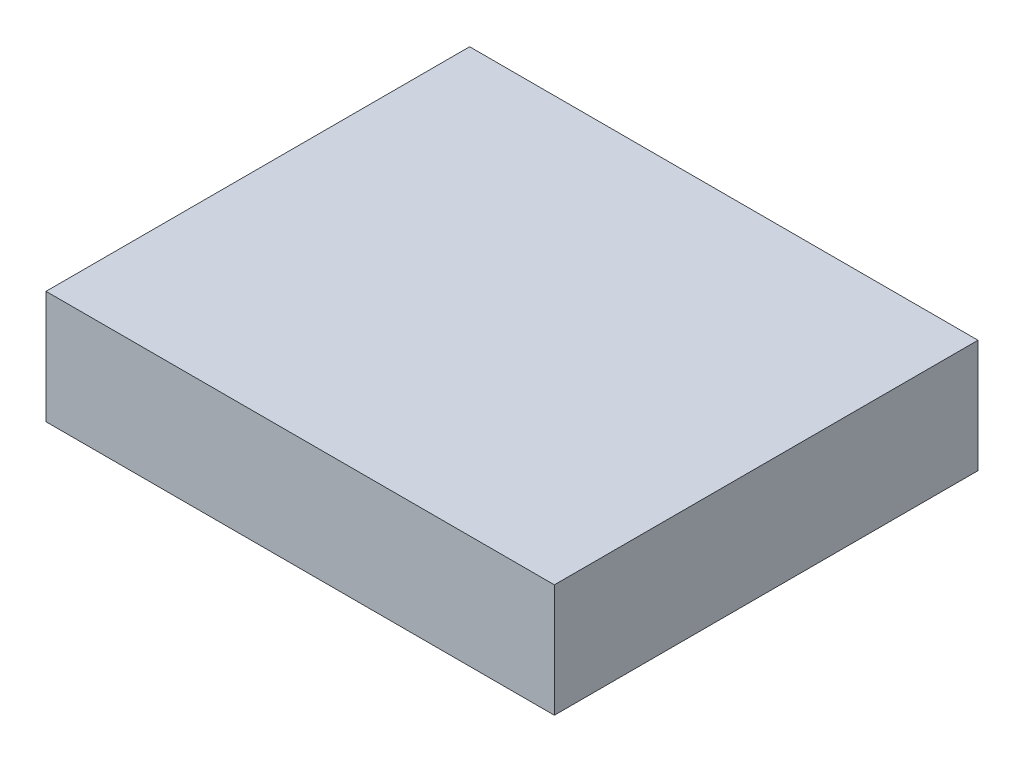
ISO-10303-21;
HEADER;
FILE_DESCRIPTION(('STEP AP214'),'2;1');
FILE_NAME('part.step','',(''),(''),'','','');
FILE_SCHEMA(('AUTOMOTIVE_DESIGN { 1 0 10303 214 1 1 1 1 }'));
ENDSEC;
DATA;
#1=APPLICATION_CONTEXT('core data for automotive mechanical design processes');
#2=APPLICATION_PROTOCOL_DEFINITION('international standard','automotive_design',2000,#1);
#3=PRODUCT_CONTEXT('',#1,'mechanical');
#4=PRODUCT('Part','Part','',(#3));
#5=PRODUCT_RELATED_PRODUCT_CATEGORY('part','',(#4));
#6=PRODUCT_DEFINITION_FORMATION('','',#4);
#7=PRODUCT_DEFINITION_CONTEXT('part definition',#1,'design');
#8=PRODUCT_DEFINITION('design','',#6,#7);
#9=PRODUCT_DEFINITION_SHAPE('','',#8);
#10=(LENGTH_UNIT() NAMED_UNIT(*) SI_UNIT(.MILLI.,.METRE.));
#11=(NAMED_UNIT(*) PLANE_ANGLE_UNIT() SI_UNIT($,.RADIAN.));
#12=(NAMED_UNIT(*) SI_UNIT($,.STERADIAN.) SOLID_ANGLE_UNIT());
#13=UNCERTAINTY_MEASURE_WITH_UNIT(LENGTH_MEASURE(1.E-05),#10,'distance_accuracy_value','');
#14=(GEOMETRIC_REPRESENTATION_CONTEXT(3) GLOBAL_UNCERTAINTY_ASSIGNED_CONTEXT((#13)) GLOBAL_UNIT_ASSIGNED_CONTEXT((#10,
#11,#12)) REPRESENTATION_CONTEXT('',''));
#15=CARTESIAN_POINT('',(0.,0.,0.));
#16=DIRECTION('',(0.,0.,1.));
#17=DIRECTION('',(1.,0.,0.));
#18=AXIS2_PLACEMENT_3D('',#15,#16,#17);
#19=CARTESIAN_POINT('',(-6.3,0.199999999999998,-11.85));
#20=DIRECTION('',(0.,1.,0.));
#21=DIRECTION('',(0.,0.,1.));
#22=AXIS2_PLACEMENT_3D('',#19,#20,#21);
#23=PLANE('',#22);
#24=DIRECTION('',(-1.,0.,0.));
#25=VECTOR('',#24,1.);
#26=CARTESIAN_POINT('',(-4.5,0.199999999999998,-10.35));
#27=LINE('',#26,#25);
#28=CARTESIAN_POINT('',(-6.3,0.199999999999998,-10.35));
#29=VERTEX_POINT('',#28);
#30=CARTESIAN_POINT('',(-4.5,0.199999999999998,-10.35));
#31=VERTEX_POINT('',#30);
#32=EDGE_CURVE('E54',#29,#31,#27,.F.);
#33=ORIENTED_EDGE('',*,*,#32,.T.);
#34=DIRECTION('',(0.,0.,1.));
#35=VECTOR('',#34,1.);
#36=CARTESIAN_POINT('',(-4.5,0.199999999999998,-11.85));
#37=LINE('',#36,#35);
#38=CARTESIAN_POINT('',(-4.5,0.199999999999998,-11.85));
#39=VERTEX_POINT('',#38);
#40=EDGE_CURVE('E75',#31,#39,#37,.F.);
#41=ORIENTED_EDGE('',*,*,#40,.T.);
#42=DIRECTION('',(1.,0.,0.));
#43=VECTOR('',#42,1.);
#44=CARTESIAN_POINT('',(-4.5,0.199999999999998,-11.85));
#45=LINE('',#44,#43);
#46=CARTESIAN_POINT('',(-6.3,0.199999999999998,-11.85));
#47=VERTEX_POINT('',#46);
#48=EDGE_CURVE('E57',#39,#47,#45,.F.);
#49=ORIENTED_EDGE('',*,*,#48,.T.);
#50=DIRECTION('',(0.,0.,-1.));
#51=VECTOR('',#50,1.);
#52=CARTESIAN_POINT('',(-6.3,0.199999999999998,-11.85));
#53=LINE('',#52,#51);
#54=EDGE_CURVE('E19',#47,#29,#53,.F.);
#55=ORIENTED_EDGE('',*,*,#54,.T.);
#56=EDGE_LOOP('',(#33,#41,#49,#55));
#57=FACE_BOUND('',#56,.T.);
#58=ADVANCED_FACE('F16',(#57),#23,.T.);
#59=CARTESIAN_POINT('',(-6.3,-0.200000000000001,-11.85));
#60=DIRECTION('',(1.,0.,0.));
#61=DIRECTION('',(0.,0.,-1.));
#62=AXIS2_PLACEMENT_3D('',#59,#60,#61);
#63=PLANE('',#62);
#64=ORIENTED_EDGE('',*,*,#54,.F.);
#65=DIRECTION('',(0.,1.,0.));
#66=VECTOR('',#65,1.);
#67=CARTESIAN_POINT('',(-6.3,-0.200000000000001,-11.85));
#68=LINE('',#67,#66);
#69=CARTESIAN_POINT('',(-6.3,-0.200000000000001,-11.85));
#70=VERTEX_POINT('',#69);
#71=EDGE_CURVE('E79',#47,#70,#68,.F.);
#72=ORIENTED_EDGE('',*,*,#71,.T.);
#73=DIRECTION('',(0.,0.,1.));
#74=VECTOR('',#73,1.);
#75=CARTESIAN_POINT('',(-6.3,-0.200000000000001,-11.85));
#76=LINE('',#75,#74);
#77=CARTESIAN_POINT('',(-6.3,-0.200000000000001,-10.35));
#78=VERTEX_POINT('',#77);
#79=EDGE_CURVE('E72',#70,#78,#76,.T.);
#80=ORIENTED_EDGE('',*,*,#79,.T.);
#81=DIRECTION('',(0.,1.,0.));
#82=VECTOR('',#81,1.);
#83=CARTESIAN_POINT('',(-6.3,-0.200000000000001,-10.35));
#84=LINE('',#83,#82);
#85=EDGE_CURVE('E62',#78,#29,#84,.T.);
#86=ORIENTED_EDGE('',*,*,#85,.T.);
#87=EDGE_LOOP('',(#64,#72,#80,#86));
#88=FACE_BOUND('',#87,.T.);
#89=ADVANCED_FACE('F71',(#88),#63,.F.);
#90=CARTESIAN_POINT('',(-4.5,-0.200000000000001,-10.35));
#91=DIRECTION('',(0.,0.,-1.));
#92=DIRECTION('',(-1.,0.,0.));
#93=AXIS2_PLACEMENT_3D('',#90,#91,#92);
#94=PLANE('',#93);
#95=ORIENTED_EDGE('',*,*,#32,.F.);
#96=ORIENTED_EDGE('',*,*,#85,.F.);
#97=DIRECTION('',(1.,0.,0.));
#98=VECTOR('',#97,1.);
#99=CARTESIAN_POINT('',(-6.3,-0.200000000000001,-10.35));
#100=LINE('',#99,#98);
#101=CARTESIAN_POINT('',(-4.5,-0.200000000000001,-10.35));
#102=VERTEX_POINT('',#101);
#103=EDGE_CURVE('E82',#78,#102,#100,.T.);
#104=ORIENTED_EDGE('',*,*,#103,.T.);
#105=DIRECTION('',(0.,1.,0.));
#106=VECTOR('',#105,1.);
#107=CARTESIAN_POINT('',(-4.5,-0.200000000000001,-10.35));
#108=LINE('',#107,#106);
#109=EDGE_CURVE('E68',#102,#31,#108,.T.);
#110=ORIENTED_EDGE('',*,*,#109,.T.);
#111=EDGE_LOOP('',(#95,#96,#104,#110));
#112=FACE_BOUND('',#111,.T.);
#113=ADVANCED_FACE('F65',(#112),#94,.F.);
#114=CARTESIAN_POINT('',(-4.5,-0.200000000000001,-11.85));
#115=DIRECTION('',(-1.,0.,0.));
#116=DIRECTION('',(0.,0.,1.));
#117=AXIS2_PLACEMENT_3D('',#114,#115,#116);
#118=PLANE('',#117);
#119=ORIENTED_EDGE('',*,*,#40,.F.);
#120=ORIENTED_EDGE('',*,*,#109,.F.);
#121=DIRECTION('',(0.,0.,1.));
#122=VECTOR('',#121,1.);
#123=CARTESIAN_POINT('',(-4.5,-0.200000000000001,-11.85));
#124=LINE('',#123,#122);
#125=CARTESIAN_POINT('',(-4.5,-0.200000000000001,-11.85));
#126=VERTEX_POINT('',#125);
#127=EDGE_CURVE('E25',#102,#126,#124,.F.);
#128=ORIENTED_EDGE('',*,*,#127,.T.);
#129=DIRECTION('',(0.,1.,0.));
#130=VECTOR('',#129,1.);
#131=CARTESIAN_POINT('',(-4.5,-0.200000000000001,-11.85));
#132=LINE('',#131,#130);
#133=EDGE_CURVE('E33',#126,#39,#132,.T.);
#134=ORIENTED_EDGE('',*,*,#133,.T.);
#135=EDGE_LOOP('',(#119,#120,#128,#134));
#136=FACE_BOUND('',#135,.T.);
#137=ADVANCED_FACE('F87',(#136),#118,.F.);
#138=CARTESIAN_POINT('',(-4.5,-0.200000000000001,-11.85));
#139=DIRECTION('',(0.,0.,1.));
#140=DIRECTION('',(1.,0.,0.));
#141=AXIS2_PLACEMENT_3D('',#138,#139,#140);
#142=PLANE('',#141);
#143=ORIENTED_EDGE('',*,*,#48,.F.);
#144=ORIENTED_EDGE('',*,*,#133,.F.);
#145=DIRECTION('',(1.,0.,0.));
#146=VECTOR('',#145,1.);
#147=CARTESIAN_POINT('',(-6.3,-0.200000000000001,-11.85));
#148=LINE('',#147,#146);
#149=EDGE_CURVE('E10',#126,#70,#148,.F.);
#150=ORIENTED_EDGE('',*,*,#149,.T.);
#151=ORIENTED_EDGE('',*,*,#71,.F.);
#152=EDGE_LOOP('',(#143,#144,#150,#151));
#153=FACE_BOUND('',#152,.T.);
#154=ADVANCED_FACE('F90',(#153),#142,.F.);
#155=CARTESIAN_POINT('',(-6.3,-0.200000000000001,-11.85));
#156=DIRECTION('',(0.,1.,0.));
#157=DIRECTION('',(0.,0.,1.));
#158=AXIS2_PLACEMENT_3D('',#155,#156,#157);
#159=PLANE('',#158);
#160=ORIENTED_EDGE('',*,*,#127,.F.);
#161=ORIENTED_EDGE('',*,*,#103,.F.);
#162=ORIENTED_EDGE('',*,*,#79,.F.);
#163=ORIENTED_EDGE('',*,*,#149,.F.);
#164=EDGE_LOOP('',(#160,#161,#162,#163));
#165=FACE_BOUND('',#164,.T.);
#166=ADVANCED_FACE('F89',(#165),#159,.F.);
#167=CLOSED_SHELL('',(#58,#89,#113,#137,#154,#166));
#168=MANIFOLD_SOLID_BREP('B1',#167);
#169=ADVANCED_BREP_SHAPE_REPRESENTATION('',(#18,#168),#14);
#170=SHAPE_DEFINITION_REPRESENTATION(#9,#169);
ENDSEC;
END-ISO-10303-21;
